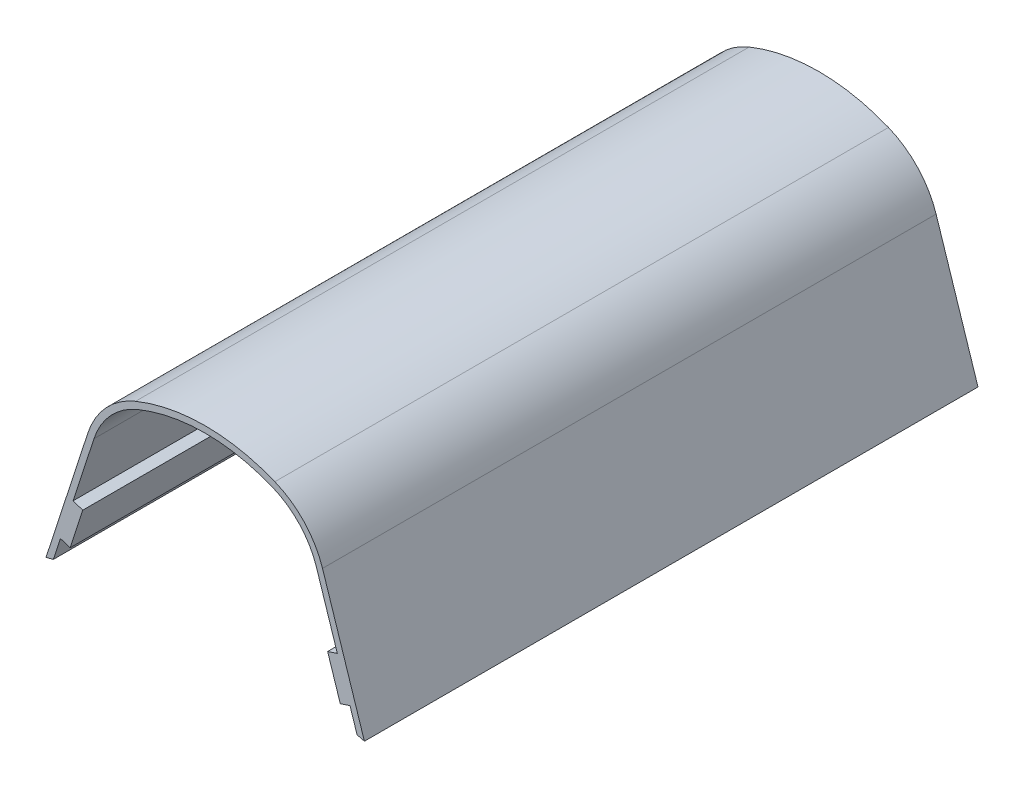
ISO-10303-21;
HEADER;
FILE_DESCRIPTION(('STEP AP214'),'2;1');
FILE_NAME('part.step','',(''),(''),'','','');
FILE_SCHEMA(('AUTOMOTIVE_DESIGN { 1 0 10303 214 1 1 1 1 }'));
ENDSEC;
DATA;
#1=APPLICATION_CONTEXT('core data for automotive mechanical design processes');
#2=APPLICATION_PROTOCOL_DEFINITION('international standard','automotive_design',2000,#1);
#3=PRODUCT_CONTEXT('',#1,'mechanical');
#4=PRODUCT('Part','Part','',(#3));
#5=PRODUCT_RELATED_PRODUCT_CATEGORY('part','',(#4));
#6=PRODUCT_DEFINITION_FORMATION('','',#4);
#7=PRODUCT_DEFINITION_CONTEXT('part definition',#1,'design');
#8=PRODUCT_DEFINITION('design','',#6,#7);
#9=PRODUCT_DEFINITION_SHAPE('','',#8);
#10=(LENGTH_UNIT() NAMED_UNIT(*) SI_UNIT(.MILLI.,.METRE.));
#11=(NAMED_UNIT(*) PLANE_ANGLE_UNIT() SI_UNIT($,.RADIAN.));
#12=(NAMED_UNIT(*) SI_UNIT($,.STERADIAN.) SOLID_ANGLE_UNIT());
#13=UNCERTAINTY_MEASURE_WITH_UNIT(LENGTH_MEASURE(1.E-05),#10,'distance_accuracy_value','');
#14=(GEOMETRIC_REPRESENTATION_CONTEXT(3) GLOBAL_UNCERTAINTY_ASSIGNED_CONTEXT((#13)) GLOBAL_UNIT_ASSIGNED_CONTEXT((#10,
#11,#12)) REPRESENTATION_CONTEXT('',''));
#15=CARTESIAN_POINT('',(0.,0.,0.));
#16=DIRECTION('',(0.,0.,1.));
#17=DIRECTION('',(1.,0.,0.));
#18=AXIS2_PLACEMENT_3D('',#15,#16,#17);
#19=CARTESIAN_POINT('',(0.,0.,152.4));
#20=DIRECTION('',(0.,0.,-1.));
#21=DIRECTION('',(-1.,0.,0.));
#22=AXIS2_PLACEMENT_3D('',#19,#20,#21);
#23=CYLINDRICAL_SURFACE('',#22,152.4);
#24=CARTESIAN_POINT('',(0.,0.,0.));
#25=DIRECTION('',(0.,0.,-1.));
#26=DIRECTION('',(1.,0.,0.));
#27=AXIS2_PLACEMENT_3D('',#24,#25,#26);
#28=CIRCLE('',#27,152.4);
#29=CARTESIAN_POINT('',(-39.5422452780142,147.180742077126,0.));
#30=VERTEX_POINT('',#29);
#31=CARTESIAN_POINT('',(-37.7172395441766,147.658964648839,0.));
#32=VERTEX_POINT('',#31);
#33=EDGE_CURVE('E205',#30,#32,#28,.T.);
#34=ORIENTED_EDGE('',*,*,#33,.T.);
#35=DIRECTION('',(0.,0.,-1.));
#36=VECTOR('',#35,1.);
#37=CARTESIAN_POINT('',(-37.7172395441766,147.658964648839,152.4));
#38=LINE('',#37,#36);
#39=CARTESIAN_POINT('',(-37.7172395441766,147.658964648839,152.4));
#40=VERTEX_POINT('',#39);
#41=EDGE_CURVE('E11',#40,#32,#38,.T.);
#42=ORIENTED_EDGE('',*,*,#41,.F.);
#43=CARTESIAN_POINT('',(0.,0.,152.4));
#44=DIRECTION('',(0.,0.,-1.));
#45=DIRECTION('',(1.,0.,0.));
#46=AXIS2_PLACEMENT_3D('',#43,#44,#45);
#47=CIRCLE('',#46,152.4);
#48=CARTESIAN_POINT('',(-39.5422452780142,147.180742077126,152.4));
#49=VERTEX_POINT('',#48);
#50=EDGE_CURVE('E245',#49,#40,#47,.T.);
#51=ORIENTED_EDGE('',*,*,#50,.F.);
#52=DIRECTION('',(0.,0.,-1.));
#53=VECTOR('',#52,1.);
#54=CARTESIAN_POINT('',(-39.5422452780142,147.180742077126,152.4));
#55=LINE('',#54,#53);
#56=EDGE_CURVE('E201',#49,#30,#55,.T.);
#57=ORIENTED_EDGE('',*,*,#56,.T.);
#58=EDGE_LOOP('',(#34,#42,#51,#57));
#59=FACE_BOUND('',#58,.T.);
#60=ADVANCED_FACE('F37',(#59),#23,.F.);
#61=CARTESIAN_POINT('',(-37.7172395441766,147.658964648839,152.4));
#62=DIRECTION('',(-0.950933726670704,0.309394646818858,0.));
#63=DIRECTION('',(-0.309394646818858,-0.950933726670704,0.));
#64=AXIS2_PLACEMENT_3D('',#61,#62,#63);
#65=PLANE('',#64);
#66=DIRECTION('',(0.309394646818858,0.950933726670705,0.));
#67=VECTOR('',#66,1.);
#68=CARTESIAN_POINT('',(-37.7172395441766,147.658964648839,0.));
#69=LINE('',#68,#67);
#70=CARTESIAN_POINT('',(-35.9654874234463,153.043027332202,0.));
#71=VERTEX_POINT('',#70);
#72=EDGE_CURVE('E208',#32,#71,#69,.T.);
#73=ORIENTED_EDGE('',*,*,#72,.T.);
#74=DIRECTION('',(0.,0.,-1.));
#75=VECTOR('',#74,1.);
#76=CARTESIAN_POINT('',(-35.9654874234463,153.043027332202,152.4));
#77=LINE('',#76,#75);
#78=CARTESIAN_POINT('',(-35.9654874234463,153.043027332202,152.4));
#79=VERTEX_POINT('',#78);
#80=EDGE_CURVE('E45',#79,#71,#77,.T.);
#81=ORIENTED_EDGE('',*,*,#80,.F.);
#82=DIRECTION('',(0.309394646818858,0.950933726670705,0.));
#83=VECTOR('',#82,1.);
#84=CARTESIAN_POINT('',(-37.7172395441766,147.658964648839,152.4));
#85=LINE('',#84,#83);
#86=EDGE_CURVE('E132',#40,#79,#85,.T.);
#87=ORIENTED_EDGE('',*,*,#86,.F.);
#88=ORIENTED_EDGE('',*,*,#41,.T.);
#89=EDGE_LOOP('',(#73,#81,#87,#88));
#90=FACE_BOUND('',#89,.T.);
#91=ADVANCED_FACE('F362',(#90),#65,.F.);
#92=CARTESIAN_POINT('',(-33.5501157577026,152.257164929282,152.4));
#93=DIRECTION('',(0.309394646818869,0.950933726670701,0.));
#94=DIRECTION('',(-0.950933726670701,0.309394646818869,0.));
#95=AXIS2_PLACEMENT_3D('',#92,#93,#94);
#96=PLANE('',#95);
#97=DIRECTION('',(0.950933726670701,-0.309394646818869,0.));
#98=VECTOR('',#97,1.);
#99=CARTESIAN_POINT('',(-33.5501157577026,152.257164929282,0.));
#100=LINE('',#99,#98);
#101=CARTESIAN_POINT('',(-33.5501157577026,152.257164929282,0.));
#102=VERTEX_POINT('',#101);
#103=EDGE_CURVE('E210',#71,#102,#100,.T.);
#104=ORIENTED_EDGE('',*,*,#103,.T.);
#105=DIRECTION('',(0.,0.,-1.));
#106=VECTOR('',#105,1.);
#107=CARTESIAN_POINT('',(-33.5501157577026,152.257164929282,152.4));
#108=LINE('',#107,#106);
#109=CARTESIAN_POINT('',(-33.5501157577026,152.257164929282,152.4));
#110=VERTEX_POINT('',#109);
#111=EDGE_CURVE('E288',#110,#102,#108,.T.);
#112=ORIENTED_EDGE('',*,*,#111,.F.);
#113=DIRECTION('',(0.950933726670701,-0.309394646818869,0.));
#114=VECTOR('',#113,1.);
#115=CARTESIAN_POINT('',(-33.5501157577026,152.257164929282,152.4));
#116=LINE('',#115,#114);
#117=EDGE_CURVE('E296',#79,#110,#116,.T.);
#118=ORIENTED_EDGE('',*,*,#117,.F.);
#119=ORIENTED_EDGE('',*,*,#80,.T.);
#120=EDGE_LOOP('',(#104,#112,#118,#119));
#121=FACE_BOUND('',#120,.T.);
#122=ADVANCED_FACE('F294',(#121),#96,.F.);
#123=CARTESIAN_POINT('',(-30.406666146023,161.918651592256,152.4));
#124=DIRECTION('',(-0.950933726670704,0.309394646818858,0.));
#125=DIRECTION('',(-0.309394646818858,-0.950933726670704,0.));
#126=AXIS2_PLACEMENT_3D('',#123,#124,#125);
#127=PLANE('',#126);
#128=DIRECTION('',(0.309394646818858,0.950933726670704,0.));
#129=VECTOR('',#128,1.);
#130=CARTESIAN_POINT('',(-30.406666146023,161.918651592256,0.));
#131=LINE('',#130,#129);
#132=CARTESIAN_POINT('',(-30.406666146023,161.918651592256,0.));
#133=VERTEX_POINT('',#132);
#134=EDGE_CURVE('E212',#102,#133,#131,.T.);
#135=ORIENTED_EDGE('',*,*,#134,.T.);
#136=DIRECTION('',(0.,0.,-1.));
#137=VECTOR('',#136,1.);
#138=CARTESIAN_POINT('',(-30.406666146023,161.918651592256,152.4));
#139=LINE('',#138,#137);
#140=CARTESIAN_POINT('',(-30.406666146023,161.918651592256,152.4));
#141=VERTEX_POINT('',#140);
#142=EDGE_CURVE('E285',#141,#133,#139,.T.);
#143=ORIENTED_EDGE('',*,*,#142,.F.);
#144=DIRECTION('',(0.309394646818858,0.950933726670704,0.));
#145=VECTOR('',#144,1.);
#146=CARTESIAN_POINT('',(-30.406666146023,161.918651592256,152.4));
#147=LINE('',#146,#145);
#148=EDGE_CURVE('E313',#110,#141,#147,.T.);
#149=ORIENTED_EDGE('',*,*,#148,.F.);
#150=ORIENTED_EDGE('',*,*,#111,.T.);
#151=EDGE_LOOP('',(#135,#143,#149,#150));
#152=FACE_BOUND('',#151,.T.);
#153=ADVANCED_FACE('F304',(#152),#127,.F.);
#154=CARTESIAN_POINT('',(-30.406666146023,161.918651592256,152.4));
#155=DIRECTION('',(-0.309394646818868,-0.950933726670701,0.));
#156=DIRECTION('',(0.950933726670701,-0.309394646818868,0.));
#157=AXIS2_PLACEMENT_3D('',#154,#155,#156);
#158=PLANE('',#157);
#159=DIRECTION('',(-0.950933726670701,0.309394646818868,0.));
#160=VECTOR('',#159,1.);
#161=CARTESIAN_POINT('',(-30.406666146023,161.918651592256,0.));
#162=LINE('',#161,#160);
#163=CARTESIAN_POINT('',(-32.8220378117666,162.704513995176,0.));
#164=VERTEX_POINT('',#163);
#165=EDGE_CURVE('E214',#133,#164,#162,.T.);
#166=ORIENTED_EDGE('',*,*,#165,.T.);
#167=DIRECTION('',(0.,0.,-1.));
#168=VECTOR('',#167,1.);
#169=CARTESIAN_POINT('',(-32.8220378117666,162.704513995176,152.4));
#170=LINE('',#169,#168);
#171=CARTESIAN_POINT('',(-32.8220378117666,162.704513995176,152.4));
#172=VERTEX_POINT('',#171);
#173=EDGE_CURVE('E282',#172,#164,#170,.T.);
#174=ORIENTED_EDGE('',*,*,#173,.F.);
#175=DIRECTION('',(-0.950933726670701,0.309394646818868,0.));
#176=VECTOR('',#175,1.);
#177=CARTESIAN_POINT('',(-30.406666146023,161.918651592256,152.4));
#178=LINE('',#177,#176);
#179=EDGE_CURVE('E310',#141,#172,#178,.T.);
#180=ORIENTED_EDGE('',*,*,#179,.F.);
#181=ORIENTED_EDGE('',*,*,#142,.T.);
#182=EDGE_LOOP('',(#166,#174,#180,#181));
#183=FACE_BOUND('',#182,.T.);
#184=ADVANCED_FACE('F308',(#183),#158,.F.);
#185=CARTESIAN_POINT('',(-27.6275874930769,178.669812846805,152.4));
#186=DIRECTION('',(-0.950933726670703,0.309394646818862,0.));
#187=DIRECTION('',(-0.309394646818862,-0.950933726670703,0.));
#188=AXIS2_PLACEMENT_3D('',#185,#186,#187);
#189=PLANE('',#188);
#190=DIRECTION('',(0.309394646818862,0.950933726670703,0.));
#191=VECTOR('',#190,1.);
#192=CARTESIAN_POINT('',(-27.6275874930769,178.669812846805,0.));
#193=LINE('',#192,#191);
#194=CARTESIAN_POINT('',(-27.6275874930769,178.669812846805,0.));
#195=VERTEX_POINT('',#194);
#196=EDGE_CURVE('E217',#164,#195,#193,.T.);
#197=ORIENTED_EDGE('',*,*,#196,.T.);
#198=DIRECTION('',(0.,0.,-1.));
#199=VECTOR('',#198,1.);
#200=CARTESIAN_POINT('',(-27.6275874930769,178.669812846805,152.4));
#201=LINE('',#200,#199);
#202=CARTESIAN_POINT('',(-27.6275874930769,178.669812846805,152.4));
#203=VERTEX_POINT('',#202);
#204=EDGE_CURVE('E279',#203,#195,#201,.T.);
#205=ORIENTED_EDGE('',*,*,#204,.F.);
#206=DIRECTION('',(0.309394646818834,0.950933726670712,0.));
#207=VECTOR('',#206,1.);
#208=CARTESIAN_POINT('',(-32.8220378117666,162.704513995176,152.4));
#209=LINE('',#208,#207);
#210=EDGE_CURVE('E312',#172,#203,#209,.T.);
#211=ORIENTED_EDGE('',*,*,#210,.F.);
#212=ORIENTED_EDGE('',*,*,#173,.T.);
#213=EDGE_LOOP('',(#197,#205,#211,#212));
#214=FACE_BOUND('',#213,.T.);
#215=ADVANCED_FACE('F375',(#214),#189,.F.);
#216=CARTESIAN_POINT('',(-9.5123,172.775844824906,152.4));
#217=DIRECTION('',(0.,0.,-1.));
#218=DIRECTION('',(-1.,0.,0.));
#219=AXIS2_PLACEMENT_3D('',#216,#217,#218);
#220=CYLINDRICAL_SURFACE('',#219,19.05);
#221=CARTESIAN_POINT('',(-9.5123,172.775844824906,0.));
#222=DIRECTION('',(0.,0.,-1.));
#223=DIRECTION('',(-1.,0.,0.));
#224=AXIS2_PLACEMENT_3D('',#221,#222,#223);
#225=CIRCLE('',#224,19.05);
#226=CARTESIAN_POINT('',(-16.7037139881468,190.416311509523,0.));
#227=VERTEX_POINT('',#226);
#228=EDGE_CURVE('E219',#195,#227,#225,.T.);
#229=ORIENTED_EDGE('',*,*,#228,.T.);
#230=DIRECTION('',(0.,0.,-1.));
#231=VECTOR('',#230,1.);
#232=CARTESIAN_POINT('',(-16.7037139881468,190.416311509523,152.4));
#233=LINE('',#232,#231);
#234=CARTESIAN_POINT('',(-16.7037139881468,190.416311509523,152.4));
#235=VERTEX_POINT('',#234);
#236=EDGE_CURVE('E276',#235,#227,#233,.T.);
#237=ORIENTED_EDGE('',*,*,#236,.F.);
#238=CARTESIAN_POINT('',(-9.5123,172.775844824906,152.4));
#239=DIRECTION('',(0.,0.,-1.));
#240=DIRECTION('',(-1.,0.,0.));
#241=AXIS2_PLACEMENT_3D('',#238,#239,#240);
#242=CIRCLE('',#241,19.05);
#243=EDGE_CURVE('E315',#203,#235,#242,.T.);
#244=ORIENTED_EDGE('',*,*,#243,.F.);
#245=ORIENTED_EDGE('',*,*,#204,.T.);
#246=EDGE_LOOP('',(#229,#237,#244,#245));
#247=FACE_BOUND('',#246,.T.);
#248=ADVANCED_FACE('F378',(#247),#220,.F.);
#249=CARTESIAN_POINT('',(0.,149.442267934372,152.4));
#250=DIRECTION('',(0.,0.,-1.));
#251=DIRECTION('',(-1.,0.,0.));
#252=AXIS2_PLACEMENT_3D('',#249,#250,#251);
#253=CYLINDRICAL_SURFACE('',#252,44.2480090839824);
#254=CARTESIAN_POINT('',(0.,149.442267934372,0.));
#255=DIRECTION('',(0.,0.,-1.));
#256=DIRECTION('',(1.,0.,0.));
#257=AXIS2_PLACEMENT_3D('',#254,#255,#256);
#258=CIRCLE('',#257,44.2480090839824);
#259=CARTESIAN_POINT('',(16.7037139881468,190.416311509523,0.));
#260=VERTEX_POINT('',#259);
#261=EDGE_CURVE('E221',#227,#260,#258,.T.);
#262=ORIENTED_EDGE('',*,*,#261,.T.);
#263=DIRECTION('',(0.,0.,-1.));
#264=VECTOR('',#263,1.);
#265=CARTESIAN_POINT('',(16.7037139881468,190.416311509523,152.4));
#266=LINE('',#265,#264);
#267=CARTESIAN_POINT('',(16.7037139881468,190.416311509523,152.4));
#268=VERTEX_POINT('',#267);
#269=EDGE_CURVE('E273',#268,#260,#266,.T.);
#270=ORIENTED_EDGE('',*,*,#269,.F.);
#271=CARTESIAN_POINT('',(0.,149.442267934372,152.4));
#272=DIRECTION('',(0.,0.,-1.));
#273=DIRECTION('',(1.,0.,0.));
#274=AXIS2_PLACEMENT_3D('',#271,#272,#273);
#275=CIRCLE('',#274,44.2480090839824);
#276=EDGE_CURVE('E321',#235,#268,#275,.T.);
#277=ORIENTED_EDGE('',*,*,#276,.F.);
#278=ORIENTED_EDGE('',*,*,#236,.T.);
#279=EDGE_LOOP('',(#262,#270,#277,#278));
#280=FACE_BOUND('',#279,.T.);
#281=ADVANCED_FACE('F382',(#280),#253,.F.);
#282=CARTESIAN_POINT('',(9.5123,172.775844824906,152.4));
#283=DIRECTION('',(0.,0.,-1.));
#284=DIRECTION('',(-1.,0.,0.));
#285=AXIS2_PLACEMENT_3D('',#282,#283,#284);
#286=CYLINDRICAL_SURFACE('',#285,19.05);
#287=CARTESIAN_POINT('',(9.5123,172.775844824906,0.));
#288=DIRECTION('',(0.,0.,-1.));
#289=DIRECTION('',(1.,0.,0.));
#290=AXIS2_PLACEMENT_3D('',#287,#288,#289);
#291=CIRCLE('',#290,19.05);
#292=CARTESIAN_POINT('',(27.6275874930769,178.669812846805,0.));
#293=VERTEX_POINT('',#292);
#294=EDGE_CURVE('E223',#260,#293,#291,.T.);
#295=ORIENTED_EDGE('',*,*,#294,.T.);
#296=DIRECTION('',(0.,0.,-1.));
#297=VECTOR('',#296,1.);
#298=CARTESIAN_POINT('',(27.6275874930769,178.669812846805,152.4));
#299=LINE('',#298,#297);
#300=CARTESIAN_POINT('',(27.6275874930769,178.669812846805,152.4));
#301=VERTEX_POINT('',#300);
#302=EDGE_CURVE('E270',#301,#293,#299,.T.);
#303=ORIENTED_EDGE('',*,*,#302,.F.);
#304=CARTESIAN_POINT('',(9.5123,172.775844824906,152.4));
#305=DIRECTION('',(0.,0.,-1.));
#306=DIRECTION('',(1.,0.,0.));
#307=AXIS2_PLACEMENT_3D('',#304,#305,#306);
#308=CIRCLE('',#307,19.05);
#309=EDGE_CURVE('E323',#268,#301,#308,.T.);
#310=ORIENTED_EDGE('',*,*,#309,.F.);
#311=ORIENTED_EDGE('',*,*,#269,.T.);
#312=EDGE_LOOP('',(#295,#303,#310,#311));
#313=FACE_BOUND('',#312,.T.);
#314=ADVANCED_FACE('F386',(#313),#286,.F.);
#315=CARTESIAN_POINT('',(32.8220378117666,162.704513995176,152.4));
#316=DIRECTION('',(0.95093372667071,0.309394646818841,0.));
#317=DIRECTION('',(-0.309394646818841,0.95093372667071,0.));
#318=AXIS2_PLACEMENT_3D('',#315,#316,#317);
#319=PLANE('',#318);
#320=DIRECTION('',(0.309394646818841,-0.95093372667071,0.));
#321=VECTOR('',#320,1.);
#322=CARTESIAN_POINT('',(32.8220378117666,162.704513995176,0.));
#323=LINE('',#322,#321);
#324=CARTESIAN_POINT('',(32.8220378117666,162.704513995176,0.));
#325=VERTEX_POINT('',#324);
#326=EDGE_CURVE('E226',#293,#325,#323,.T.);
#327=ORIENTED_EDGE('',*,*,#326,.T.);
#328=DIRECTION('',(0.,0.,-1.));
#329=VECTOR('',#328,1.);
#330=CARTESIAN_POINT('',(32.8220378117666,162.704513995176,152.4));
#331=LINE('',#330,#329);
#332=CARTESIAN_POINT('',(32.8220378117666,162.704513995176,152.4));
#333=VERTEX_POINT('',#332);
#334=EDGE_CURVE('E267',#333,#325,#331,.T.);
#335=ORIENTED_EDGE('',*,*,#334,.F.);
#336=DIRECTION('',(0.309394646818862,-0.950933726670703,0.));
#337=VECTOR('',#336,1.);
#338=CARTESIAN_POINT('',(27.6275874930769,178.669812846805,152.4));
#339=LINE('',#338,#337);
#340=EDGE_CURVE('E325',#301,#333,#339,.T.);
#341=ORIENTED_EDGE('',*,*,#340,.F.);
#342=ORIENTED_EDGE('',*,*,#302,.T.);
#343=EDGE_LOOP('',(#327,#335,#341,#342));
#344=FACE_BOUND('',#343,.T.);
#345=ADVANCED_FACE('F390',(#344),#319,.F.);
#346=CARTESIAN_POINT('',(30.406666146023,161.918651592256,152.4));
#347=DIRECTION('',(0.309394646818834,-0.950933726670713,0.));
#348=DIRECTION('',(0.950933726670712,0.309394646818834,0.));
#349=AXIS2_PLACEMENT_3D('',#346,#347,#348);
#350=PLANE('',#349);
#351=DIRECTION('',(-0.950933726670712,-0.309394646818834,0.));
#352=VECTOR('',#351,1.);
#353=CARTESIAN_POINT('',(30.406666146023,161.918651592256,0.));
#354=LINE('',#353,#352);
#355=CARTESIAN_POINT('',(30.406666146023,161.918651592256,0.));
#356=VERTEX_POINT('',#355);
#357=EDGE_CURVE('E228',#325,#356,#354,.T.);
#358=ORIENTED_EDGE('',*,*,#357,.T.);
#359=DIRECTION('',(0.,0.,-1.));
#360=VECTOR('',#359,1.);
#361=CARTESIAN_POINT('',(30.406666146023,161.918651592256,152.4));
#362=LINE('',#361,#360);
#363=CARTESIAN_POINT('',(30.406666146023,161.918651592256,152.4));
#364=VERTEX_POINT('',#363);
#365=EDGE_CURVE('E264',#364,#356,#362,.T.);
#366=ORIENTED_EDGE('',*,*,#365,.F.);
#367=DIRECTION('',(-0.950933726670712,-0.309394646818834,0.));
#368=VECTOR('',#367,1.);
#369=CARTESIAN_POINT('',(30.406666146023,161.918651592256,152.4));
#370=LINE('',#369,#368);
#371=EDGE_CURVE('E327',#333,#364,#370,.T.);
#372=ORIENTED_EDGE('',*,*,#371,.F.);
#373=ORIENTED_EDGE('',*,*,#334,.T.);
#374=EDGE_LOOP('',(#358,#366,#372,#373));
#375=FACE_BOUND('',#374,.T.);
#376=ADVANCED_FACE('F394',(#375),#350,.F.);
#377=CARTESIAN_POINT('',(30.406666146023,161.918651592256,152.4));
#378=DIRECTION('',(0.950933726670704,0.309394646818858,0.));
#379=DIRECTION('',(-0.309394646818858,0.950933726670704,0.));
#380=AXIS2_PLACEMENT_3D('',#377,#378,#379);
#381=PLANE('',#380);
#382=DIRECTION('',(0.309394646818858,-0.950933726670704,0.));
#383=VECTOR('',#382,1.);
#384=CARTESIAN_POINT('',(30.406666146023,161.918651592256,0.));
#385=LINE('',#384,#383);
#386=CARTESIAN_POINT('',(33.5501157577026,152.257164929282,0.));
#387=VERTEX_POINT('',#386);
#388=EDGE_CURVE('E230',#356,#387,#385,.T.);
#389=ORIENTED_EDGE('',*,*,#388,.T.);
#390=DIRECTION('',(0.,0.,-1.));
#391=VECTOR('',#390,1.);
#392=CARTESIAN_POINT('',(33.5501157577026,152.257164929282,152.4));
#393=LINE('',#392,#391);
#394=CARTESIAN_POINT('',(33.5501157577026,152.257164929282,152.4));
#395=VERTEX_POINT('',#394);
#396=EDGE_CURVE('E261',#395,#387,#393,.T.);
#397=ORIENTED_EDGE('',*,*,#396,.F.);
#398=DIRECTION('',(0.309394646818858,-0.950933726670704,0.));
#399=VECTOR('',#398,1.);
#400=CARTESIAN_POINT('',(30.406666146023,161.918651592256,152.4));
#401=LINE('',#400,#399);
#402=EDGE_CURVE('E329',#364,#395,#401,.T.);
#403=ORIENTED_EDGE('',*,*,#402,.F.);
#404=ORIENTED_EDGE('',*,*,#365,.T.);
#405=EDGE_LOOP('',(#389,#397,#403,#404));
#406=FACE_BOUND('',#405,.T.);
#407=ADVANCED_FACE('F398',(#406),#381,.F.);
#408=CARTESIAN_POINT('',(33.5501157577026,152.257164929282,152.4));
#409=DIRECTION('',(-0.309394646818835,0.950933726670712,0.));
#410=DIRECTION('',(-0.950933726670712,-0.309394646818835,0.));
#411=AXIS2_PLACEMENT_3D('',#408,#409,#410);
#412=PLANE('',#411);
#413=DIRECTION('',(0.950933726670712,0.309394646818835,0.));
#414=VECTOR('',#413,1.);
#415=CARTESIAN_POINT('',(33.5501157577026,152.257164929282,0.));
#416=LINE('',#415,#414);
#417=CARTESIAN_POINT('',(35.9654874234462,153.043027332201,0.));
#418=VERTEX_POINT('',#417);
#419=EDGE_CURVE('E232',#387,#418,#416,.T.);
#420=ORIENTED_EDGE('',*,*,#419,.T.);
#421=DIRECTION('',(0.,0.,-1.));
#422=VECTOR('',#421,1.);
#423=CARTESIAN_POINT('',(35.9654874234462,153.043027332201,152.4));
#424=LINE('',#423,#422);
#425=CARTESIAN_POINT('',(35.9654874234462,153.043027332201,152.4));
#426=VERTEX_POINT('',#425);
#427=EDGE_CURVE('E258',#426,#418,#424,.T.);
#428=ORIENTED_EDGE('',*,*,#427,.F.);
#429=DIRECTION('',(0.950933726670712,0.309394646818835,0.));
#430=VECTOR('',#429,1.);
#431=CARTESIAN_POINT('',(33.5501157577026,152.257164929282,152.4));
#432=LINE('',#431,#430);
#433=EDGE_CURVE('E331',#395,#426,#432,.T.);
#434=ORIENTED_EDGE('',*,*,#433,.F.);
#435=ORIENTED_EDGE('',*,*,#396,.T.);
#436=EDGE_LOOP('',(#420,#428,#434,#435));
#437=FACE_BOUND('',#436,.T.);
#438=ADVANCED_FACE('F402',(#437),#412,.F.);
#439=CARTESIAN_POINT('',(37.7172395441766,147.658964648839,152.4));
#440=DIRECTION('',(0.9509337266707,0.309394646818873,0.));
#441=DIRECTION('',(-0.309394646818873,0.9509337266707,0.));
#442=AXIS2_PLACEMENT_3D('',#439,#440,#441);
#443=PLANE('',#442);
#444=DIRECTION('',(0.309394646818873,-0.9509337266707,0.));
#445=VECTOR('',#444,1.);
#446=CARTESIAN_POINT('',(37.7172395441766,147.658964648839,0.));
#447=LINE('',#446,#445);
#448=CARTESIAN_POINT('',(37.7172395441766,147.658964648839,0.));
#449=VERTEX_POINT('',#448);
#450=EDGE_CURVE('E234',#418,#449,#447,.T.);
#451=ORIENTED_EDGE('',*,*,#450,.T.);
#452=DIRECTION('',(0.,0.,-1.));
#453=VECTOR('',#452,1.);
#454=CARTESIAN_POINT('',(37.7172395441766,147.658964648839,152.4));
#455=LINE('',#454,#453);
#456=CARTESIAN_POINT('',(37.7172395441766,147.658964648839,152.4));
#457=VERTEX_POINT('',#456);
#458=EDGE_CURVE('E255',#457,#449,#455,.T.);
#459=ORIENTED_EDGE('',*,*,#458,.F.);
#460=DIRECTION('',(0.309394646818873,-0.9509337266707,0.));
#461=VECTOR('',#460,1.);
#462=CARTESIAN_POINT('',(37.7172395441766,147.658964648839,152.4));
#463=LINE('',#462,#461);
#464=EDGE_CURVE('E333',#426,#457,#463,.T.);
#465=ORIENTED_EDGE('',*,*,#464,.F.);
#466=ORIENTED_EDGE('',*,*,#427,.T.);
#467=EDGE_LOOP('',(#451,#459,#465,#466));
#468=FACE_BOUND('',#467,.T.);
#469=ADVANCED_FACE('F406',(#468),#443,.F.);
#470=CARTESIAN_POINT('',(0.,0.,152.4));
#471=DIRECTION('',(0.,0.,-1.));
#472=DIRECTION('',(-1.,0.,0.));
#473=AXIS2_PLACEMENT_3D('',#470,#471,#472);
#474=CYLINDRICAL_SURFACE('',#473,152.4);
#475=CARTESIAN_POINT('',(0.,0.,0.));
#476=DIRECTION('',(0.,0.,-1.));
#477=DIRECTION('',(1.,0.,0.));
#478=AXIS2_PLACEMENT_3D('',#475,#476,#477);
#479=CIRCLE('',#478,152.4);
#480=CARTESIAN_POINT('',(39.5422452780172,147.180742077125,0.));
#481=VERTEX_POINT('',#480);
#482=EDGE_CURVE('E236',#449,#481,#479,.T.);
#483=ORIENTED_EDGE('',*,*,#482,.T.);
#484=DIRECTION('',(0.,0.,-1.));
#485=VECTOR('',#484,1.);
#486=CARTESIAN_POINT('',(39.5422452780172,147.180742077125,152.4));
#487=LINE('',#486,#485);
#488=CARTESIAN_POINT('',(39.5422452780172,147.180742077125,152.4));
#489=VERTEX_POINT('',#488);
#490=EDGE_CURVE('E252',#489,#481,#487,.T.);
#491=ORIENTED_EDGE('',*,*,#490,.F.);
#492=CARTESIAN_POINT('',(0.,0.,152.4));
#493=DIRECTION('',(0.,0.,-1.));
#494=DIRECTION('',(1.,0.,0.));
#495=AXIS2_PLACEMENT_3D('',#492,#493,#494);
#496=CIRCLE('',#495,152.4);
#497=EDGE_CURVE('E335',#457,#489,#496,.T.);
#498=ORIENTED_EDGE('',*,*,#497,.F.);
#499=ORIENTED_EDGE('',*,*,#458,.T.);
#500=EDGE_LOOP('',(#483,#491,#498,#499));
#501=FACE_BOUND('',#500,.T.);
#502=ADVANCED_FACE('F410',(#501),#474,.F.);
#503=CARTESIAN_POINT('',(29.1371947841667,179.16097684863,152.4));
#504=DIRECTION('',(-0.950933726670704,-0.309394646818861,0.));
#505=DIRECTION('',(0.309394646818861,-0.950933726670704,0.));
#506=AXIS2_PLACEMENT_3D('',#503,#504,#505);
#507=PLANE('',#506);
#508=DIRECTION('',(-0.309394646818861,0.950933726670704,0.));
#509=VECTOR('',#508,1.);
#510=CARTESIAN_POINT('',(29.1371947841667,179.16097684863,0.));
#511=LINE('',#510,#509);
#512=CARTESIAN_POINT('',(29.1371947632545,179.160976841826,0.));
#513=VERTEX_POINT('',#512);
#514=EDGE_CURVE('E238',#481,#513,#511,.T.);
#515=ORIENTED_EDGE('',*,*,#514,.T.);
#516=DIRECTION('',(0.,0.,-1.));
#517=VECTOR('',#516,1.);
#518=CARTESIAN_POINT('',(29.1371947632545,179.160976841826,152.4));
#519=LINE('',#518,#517);
#520=CARTESIAN_POINT('',(29.1371947632545,179.160976841826,152.4));
#521=VERTEX_POINT('',#520);
#522=EDGE_CURVE('E249',#521,#513,#519,.T.);
#523=ORIENTED_EDGE('',*,*,#522,.F.);
#524=DIRECTION('',(-0.309394646818861,0.950933726670704,0.));
#525=VECTOR('',#524,1.);
#526=CARTESIAN_POINT('',(29.1371947841667,179.16097684863,152.4));
#527=LINE('',#526,#525);
#528=EDGE_CURVE('E337',#489,#521,#527,.T.);
#529=ORIENTED_EDGE('',*,*,#528,.F.);
#530=ORIENTED_EDGE('',*,*,#490,.T.);
#531=EDGE_LOOP('',(#515,#523,#529,#530));
#532=FACE_BOUND('',#531,.T.);
#533=ADVANCED_FACE('F343',(#532),#507,.F.);
#534=CARTESIAN_POINT('',(9.5123,172.775844824906,152.4));
#535=DIRECTION('',(0.,0.,-1.));
#536=DIRECTION('',(-1.,0.,0.));
#537=AXIS2_PLACEMENT_3D('',#534,#535,#536);
#538=CYLINDRICAL_SURFACE('',#537,20.6374999780088);
#539=CARTESIAN_POINT('',(9.5123,172.775844824906,0.));
#540=DIRECTION('',(0.,0.,1.));
#541=DIRECTION('',(1.,0.,0.));
#542=AXIS2_PLACEMENT_3D('',#539,#540,#541);
#543=CIRCLE('',#542,20.6374999780088);
#544=CARTESIAN_POINT('',(17.3029984705556,191.88635035918,0.));
#545=VERTEX_POINT('',#544);
#546=EDGE_CURVE('E240',#513,#545,#543,.T.);
#547=ORIENTED_EDGE('',*,*,#546,.T.);
#548=DIRECTION('',(0.,0.,-1.));
#549=VECTOR('',#548,1.);
#550=CARTESIAN_POINT('',(17.3029984705556,191.88635035918,152.4));
#551=LINE('',#550,#549);
#552=CARTESIAN_POINT('',(17.3029984705556,191.88635035918,152.4));
#553=VERTEX_POINT('',#552);
#554=EDGE_CURVE('E196',#553,#545,#551,.T.);
#555=ORIENTED_EDGE('',*,*,#554,.F.);
#556=CARTESIAN_POINT('',(9.5123,172.775844824906,152.4));
#557=DIRECTION('',(0.,0.,1.));
#558=DIRECTION('',(1.,0.,0.));
#559=AXIS2_PLACEMENT_3D('',#556,#557,#558);
#560=CIRCLE('',#559,20.6374999780088);
#561=EDGE_CURVE('E187',#521,#553,#560,.T.);
#562=ORIENTED_EDGE('',*,*,#561,.F.);
#563=ORIENTED_EDGE('',*,*,#522,.T.);
#564=EDGE_LOOP('',(#547,#555,#562,#563));
#565=FACE_BOUND('',#564,.T.);
#566=ADVANCED_FACE('F347',(#565),#538,.T.);
#567=CARTESIAN_POINT('',(0.,149.442267934372,152.4));
#568=DIRECTION('',(0.,0.,-1.));
#569=DIRECTION('',(-1.,0.,0.));
#570=AXIS2_PLACEMENT_3D('',#567,#568,#569);
#571=CYLINDRICAL_SURFACE('',#570,45.83550904);
#572=CARTESIAN_POINT('',(0.,149.442267934372,0.));
#573=DIRECTION('',(0.,0.,1.));
#574=DIRECTION('',(1.,0.,0.));
#575=AXIS2_PLACEMENT_3D('',#572,#573,#574);
#576=CIRCLE('',#575,45.83550904);
#577=CARTESIAN_POINT('',(-17.3029984788573,191.886350379544,0.));
#578=VERTEX_POINT('',#577);
#579=EDGE_CURVE('E195',#545,#578,#576,.T.);
#580=ORIENTED_EDGE('',*,*,#579,.T.);
#581=DIRECTION('',(0.,0.,-1.));
#582=VECTOR('',#581,1.);
#583=CARTESIAN_POINT('',(-17.3029984788573,191.886350379544,152.4));
#584=LINE('',#583,#582);
#585=CARTESIAN_POINT('',(-17.3029984788573,191.886350379544,152.4));
#586=VERTEX_POINT('',#585);
#587=EDGE_CURVE('E192',#586,#578,#584,.T.);
#588=ORIENTED_EDGE('',*,*,#587,.F.);
#589=CARTESIAN_POINT('',(0.,149.442267934372,152.4));
#590=DIRECTION('',(0.,0.,1.));
#591=DIRECTION('',(1.,0.,0.));
#592=AXIS2_PLACEMENT_3D('',#589,#590,#591);
#593=CIRCLE('',#592,45.83550904);
#594=EDGE_CURVE('E181',#553,#586,#593,.T.);
#595=ORIENTED_EDGE('',*,*,#594,.F.);
#596=ORIENTED_EDGE('',*,*,#554,.T.);
#597=EDGE_LOOP('',(#580,#588,#595,#596));
#598=FACE_BOUND('',#597,.T.);
#599=ADVANCED_FACE('F193',(#598),#571,.T.);
#600=CARTESIAN_POINT('',(-9.5123,172.775844824906,152.4));
#601=DIRECTION('',(0.,0.,-1.));
#602=DIRECTION('',(-1.,0.,0.));
#603=AXIS2_PLACEMENT_3D('',#600,#601,#602);
#604=CYLINDRICAL_SURFACE('',#603,20.6374999780088);
#605=CARTESIAN_POINT('',(-9.5123,172.775844824906,0.));
#606=DIRECTION('',(0.,0.,1.));
#607=DIRECTION('',(-1.,0.,0.));
#608=AXIS2_PLACEMENT_3D('',#605,#606,#607);
#609=CIRCLE('',#608,20.6374999780088);
#610=CARTESIAN_POINT('',(-29.1371947841667,179.16097684863,0.));
#611=VERTEX_POINT('',#610);
#612=EDGE_CURVE('E118',#578,#611,#609,.T.);
#613=ORIENTED_EDGE('',*,*,#612,.T.);
#614=DIRECTION('',(0.,0.,-1.));
#615=VECTOR('',#614,1.);
#616=CARTESIAN_POINT('',(-29.1371947841667,179.16097684863,152.4));
#617=LINE('',#616,#615);
#618=CARTESIAN_POINT('',(-29.1371947841667,179.16097684863,152.4));
#619=VERTEX_POINT('',#618);
#620=EDGE_CURVE('E197',#619,#611,#617,.T.);
#621=ORIENTED_EDGE('',*,*,#620,.F.);
#622=CARTESIAN_POINT('',(-9.5123,172.775844824906,152.4));
#623=DIRECTION('',(0.,0.,1.));
#624=DIRECTION('',(-1.,0.,0.));
#625=AXIS2_PLACEMENT_3D('',#622,#623,#624);
#626=CIRCLE('',#625,20.6374999780088);
#627=EDGE_CURVE('E185',#586,#619,#626,.T.);
#628=ORIENTED_EDGE('',*,*,#627,.F.);
#629=ORIENTED_EDGE('',*,*,#587,.T.);
#630=EDGE_LOOP('',(#613,#621,#628,#629));
#631=FACE_BOUND('',#630,.T.);
#632=ADVANCED_FACE('F199',(#631),#604,.T.);
#633=CARTESIAN_POINT('',(-29.1371947841667,179.16097684863,152.4));
#634=DIRECTION('',(0.950933726670728,-0.309394646818786,0.));
#635=DIRECTION('',(0.309394646818786,0.950933726670728,0.));
#636=AXIS2_PLACEMENT_3D('',#633,#634,#635);
#637=PLANE('',#636);
#638=DIRECTION('',(-0.309394646818786,-0.950933726670728,0.));
#639=VECTOR('',#638,1.);
#640=CARTESIAN_POINT('',(-29.1371947841667,179.16097684863,0.));
#641=LINE('',#640,#639);
#642=EDGE_CURVE('E124',#611,#30,#641,.T.);
#643=ORIENTED_EDGE('',*,*,#642,.T.);
#644=ORIENTED_EDGE('',*,*,#56,.F.);
#645=DIRECTION('',(-0.309394646818786,-0.950933726670728,0.));
#646=VECTOR('',#645,1.);
#647=CARTESIAN_POINT('',(-29.1371947841667,179.16097684863,152.4));
#648=LINE('',#647,#646);
#649=EDGE_CURVE('E53',#619,#49,#648,.T.);
#650=ORIENTED_EDGE('',*,*,#649,.F.);
#651=ORIENTED_EDGE('',*,*,#620,.T.);
#652=EDGE_LOOP('',(#643,#644,#650,#651));
#653=FACE_BOUND('',#652,.T.);
#654=ADVANCED_FACE('F351',(#653),#637,.F.);
#655=CARTESIAN_POINT('',(0.,0.,152.4));
#656=DIRECTION('',(0.,0.,1.));
#657=DIRECTION('',(1.,0.,0.));
#658=AXIS2_PLACEMENT_3D('',#655,#656,#657);
#659=PLANE('',#658);
#660=ORIENTED_EDGE('',*,*,#50,.T.);
#661=ORIENTED_EDGE('',*,*,#86,.T.);
#662=ORIENTED_EDGE('',*,*,#117,.T.);
#663=ORIENTED_EDGE('',*,*,#148,.T.);
#664=ORIENTED_EDGE('',*,*,#179,.T.);
#665=ORIENTED_EDGE('',*,*,#210,.T.);
#666=ORIENTED_EDGE('',*,*,#243,.T.);
#667=ORIENTED_EDGE('',*,*,#276,.T.);
#668=ORIENTED_EDGE('',*,*,#309,.T.);
#669=ORIENTED_EDGE('',*,*,#340,.T.);
#670=ORIENTED_EDGE('',*,*,#371,.T.);
#671=ORIENTED_EDGE('',*,*,#402,.T.);
#672=ORIENTED_EDGE('',*,*,#433,.T.);
#673=ORIENTED_EDGE('',*,*,#464,.T.);
#674=ORIENTED_EDGE('',*,*,#497,.T.);
#675=ORIENTED_EDGE('',*,*,#528,.T.);
#676=ORIENTED_EDGE('',*,*,#561,.T.);
#677=ORIENTED_EDGE('',*,*,#594,.T.);
#678=ORIENTED_EDGE('',*,*,#627,.T.);
#679=ORIENTED_EDGE('',*,*,#649,.T.);
#680=EDGE_LOOP('',(#660,#661,#662,#663,#664,#665,#666,#667,#668,#669,#670,#671,#672,#673,#674,
#675,#676,#677,#678,#679));
#681=FACE_BOUND('',#680,.T.);
#682=ADVANCED_FACE('F183',(#681),#659,.T.);
#683=CARTESIAN_POINT('',(0.,0.,0.));
#684=DIRECTION('',(0.,0.,1.));
#685=DIRECTION('',(1.,0.,0.));
#686=AXIS2_PLACEMENT_3D('',#683,#684,#685);
#687=PLANE('',#686);
#688=ORIENTED_EDGE('',*,*,#33,.F.);
#689=ORIENTED_EDGE('',*,*,#642,.F.);
#690=ORIENTED_EDGE('',*,*,#612,.F.);
#691=ORIENTED_EDGE('',*,*,#579,.F.);
#692=ORIENTED_EDGE('',*,*,#546,.F.);
#693=ORIENTED_EDGE('',*,*,#514,.F.);
#694=ORIENTED_EDGE('',*,*,#482,.F.);
#695=ORIENTED_EDGE('',*,*,#450,.F.);
#696=ORIENTED_EDGE('',*,*,#419,.F.);
#697=ORIENTED_EDGE('',*,*,#388,.F.);
#698=ORIENTED_EDGE('',*,*,#357,.F.);
#699=ORIENTED_EDGE('',*,*,#326,.F.);
#700=ORIENTED_EDGE('',*,*,#294,.F.);
#701=ORIENTED_EDGE('',*,*,#261,.F.);
#702=ORIENTED_EDGE('',*,*,#228,.F.);
#703=ORIENTED_EDGE('',*,*,#196,.F.);
#704=ORIENTED_EDGE('',*,*,#165,.F.);
#705=ORIENTED_EDGE('',*,*,#134,.F.);
#706=ORIENTED_EDGE('',*,*,#103,.F.);
#707=ORIENTED_EDGE('',*,*,#72,.F.);
#708=EDGE_LOOP('',(#688,#689,#690,#691,#692,#693,#694,#695,#696,#697,#698,#699,#700,#701,#702,
#703,#704,#705,#706,#707));
#709=FACE_BOUND('',#708,.T.);
#710=ADVANCED_FACE('F300',(#709),#687,.F.);
#711=CLOSED_SHELL('',(#60,#91,#122,#153,#184,#215,#248,#281,#314,#345,#376,#407,#438,#469,#502,
#533,#566,#599,#632,#654,#682,#710));
#712=MANIFOLD_SOLID_BREP('B2',#711);
#713=ADVANCED_BREP_SHAPE_REPRESENTATION('',(#18,#712),#14);
#714=SHAPE_DEFINITION_REPRESENTATION(#9,#713);
ENDSEC;
END-ISO-10303-21;
